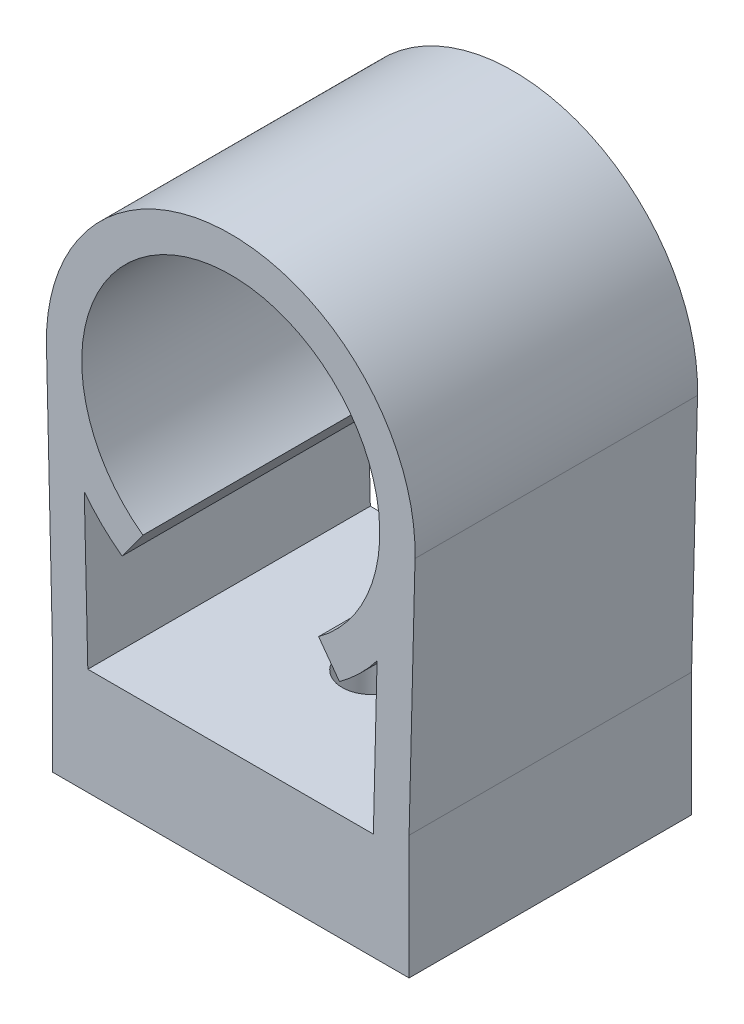
ISO-10303-21;
HEADER;
FILE_DESCRIPTION(('STEP AP214'),'2;1');
FILE_NAME('part.step','',(''),(''),'','','');
FILE_SCHEMA(('AUTOMOTIVE_DESIGN { 1 0 10303 214 1 1 1 1 }'));
ENDSEC;
DATA;
#1=APPLICATION_CONTEXT('core data for automotive mechanical design processes');
#2=APPLICATION_PROTOCOL_DEFINITION('international standard','automotive_design',2000,#1);
#3=PRODUCT_CONTEXT('',#1,'mechanical');
#4=PRODUCT('Part','Part','',(#3));
#5=PRODUCT_RELATED_PRODUCT_CATEGORY('part','',(#4));
#6=PRODUCT_DEFINITION_FORMATION('','',#4);
#7=PRODUCT_DEFINITION_CONTEXT('part definition',#1,'design');
#8=PRODUCT_DEFINITION('design','',#6,#7);
#9=PRODUCT_DEFINITION_SHAPE('','',#8);
#10=(LENGTH_UNIT() NAMED_UNIT(*) SI_UNIT(.MILLI.,.METRE.));
#11=(NAMED_UNIT(*) PLANE_ANGLE_UNIT() SI_UNIT($,.RADIAN.));
#12=(NAMED_UNIT(*) SI_UNIT($,.STERADIAN.) SOLID_ANGLE_UNIT());
#13=UNCERTAINTY_MEASURE_WITH_UNIT(LENGTH_MEASURE(1.E-05),#10,'distance_accuracy_value','');
#14=(GEOMETRIC_REPRESENTATION_CONTEXT(3) GLOBAL_UNCERTAINTY_ASSIGNED_CONTEXT((#13)) GLOBAL_UNIT_ASSIGNED_CONTEXT((#10,
#11,#12)) REPRESENTATION_CONTEXT('',''));
#15=CARTESIAN_POINT('',(0.,0.,0.));
#16=DIRECTION('',(0.,0.,1.));
#17=DIRECTION('',(1.,0.,0.));
#18=AXIS2_PLACEMENT_3D('',#15,#16,#17);
#19=CARTESIAN_POINT('',(12.827,26.67,20.32));
#20=DIRECTION('',(0.,0.,1.));
#21=DIRECTION('',(1.,0.,0.));
#22=AXIS2_PLACEMENT_3D('',#19,#20,#21);
#23=PLANE('',#22);
#24=DIRECTION('',(0.,-1.,0.));
#25=VECTOR('',#24,1.);
#26=CARTESIAN_POINT('',(0.,0.,20.32));
#27=LINE('',#26,#25);
#28=CARTESIAN_POINT('',(0.,7.874,20.32));
#29=VERTEX_POINT('',#28);
#30=CARTESIAN_POINT('',(0.,0.,20.32));
#31=VERTEX_POINT('',#30);
#32=EDGE_CURVE('E204',#29,#31,#27,.T.);
#33=ORIENTED_EDGE('',*,*,#32,.T.);
#34=DIRECTION('',(1.,0.,0.));
#35=VECTOR('',#34,1.);
#36=CARTESIAN_POINT('',(0.,0.,20.32));
#37=LINE('',#36,#35);
#38=CARTESIAN_POINT('',(25.654,0.,20.32));
#39=VERTEX_POINT('',#38);
#40=EDGE_CURVE('E207',#31,#39,#37,.T.);
#41=ORIENTED_EDGE('',*,*,#40,.T.);
#42=DIRECTION('',(0.,1.,0.));
#43=VECTOR('',#42,1.);
#44=CARTESIAN_POINT('',(25.654,0.,20.32));
#45=LINE('',#44,#43);
#46=CARTESIAN_POINT('',(25.654,8.89,20.32));
#47=VERTEX_POINT('',#46);
#48=EDGE_CURVE('E210',#39,#47,#45,.T.);
#49=ORIENTED_EDGE('',*,*,#48,.T.);
#50=DIRECTION('',(0.0245023063150946,0.999699773424622,0.));
#51=VECTOR('',#50,1.);
#52=CARTESIAN_POINT('',(25.654,8.89,20.32));
#53=LINE('',#52,#51);
#54=CARTESIAN_POINT('',(26.0818193558824,26.3451288210294,20.32));
#55=VERTEX_POINT('',#54);
#56=EDGE_CURVE('E212',#47,#55,#53,.T.);
#57=ORIENTED_EDGE('',*,*,#56,.T.);
#58=CARTESIAN_POINT('',(12.827,26.67,20.32));
#59=DIRECTION('',(0.,0.,1.));
#60=DIRECTION('',(1.,0.,0.));
#61=AXIS2_PLACEMENT_3D('',#58,#59,#60);
#62=CIRCLE('',#61,13.2588);
#63=CARTESIAN_POINT('',(-0.428244850040576,26.3629797963115,20.32));
#64=VERTEX_POINT('',#63);
#65=EDGE_CURVE('E214',#55,#64,#62,.T.);
#66=ORIENTED_EDGE('',*,*,#65,.T.);
#67=DIRECTION('',(0.0231559570766986,-0.999731864877709,0.));
#68=VECTOR('',#67,1.);
#69=CARTESIAN_POINT('',(0.,7.874,20.32));
#70=LINE('',#69,#68);
#71=EDGE_CURVE('E216',#64,#29,#70,.T.);
#72=ORIENTED_EDGE('',*,*,#71,.T.);
#73=EDGE_LOOP('',(#33,#41,#49,#57,#66,#72));
#74=FACE_BOUND('',#73,.T.);
#75=DIRECTION('',(0.0231559570766986,-0.999731864877709,0.));
#76=VECTOR('',#75,1.);
#77=CARTESIAN_POINT('',(2.54519400540802,7.67916678765708,20.32));
#78=LINE('',#77,#76);
#79=CARTESIAN_POINT('',(2.29178419648612,18.6198443857655,20.32));
#80=VERTEX_POINT('',#79);
#81=CARTESIAN_POINT('',(2.54519400540802,7.67916678765708,20.32));
#82=VERTEX_POINT('',#81);
#83=EDGE_CURVE('E145',#80,#82,#78,.T.);
#84=ORIENTED_EDGE('',*,*,#83,.F.);
#85=CARTESIAN_POINT('',(12.827,26.67,20.32));
#86=DIRECTION('',(0.,0.,-1.));
#87=DIRECTION('',(1.,0.,0.));
#88=AXIS2_PLACEMENT_3D('',#85,#86,#87);
#89=CIRCLE('',#88,13.2588);
#90=CARTESIAN_POINT('',(5.00955556951835,15.9609692307692,20.32));
#91=VERTEX_POINT('',#90);
#92=EDGE_CURVE('E137',#91,#80,#89,.T.);
#93=ORIENTED_EDGE('',*,*,#92,.F.);
#94=DIRECTION('',(-0.589604219875226,-0.807692307692308,0.));
#95=VECTOR('',#94,1.);
#96=CARTESIAN_POINT('',(5.00955556951835,15.9609692307692,20.32));
#97=LINE('',#96,#95);
#98=CARTESIAN_POINT('',(6.50715028800142,18.0125076923077,20.32));
#99=VERTEX_POINT('',#98);
#100=EDGE_CURVE('E171',#99,#91,#97,.T.);
#101=ORIENTED_EDGE('',*,*,#100,.F.);
#102=CARTESIAN_POINT('',(12.827,26.67,20.32));
#103=DIRECTION('',(0.,0.,1.));
#104=DIRECTION('',(1.,0.,0.));
#105=AXIS2_PLACEMENT_3D('',#102,#103,#104);
#106=CIRCLE('',#105,10.7188);
#107=CARTESIAN_POINT('',(19.1468497119986,18.0125076923077,20.32));
#108=VERTEX_POINT('',#107);
#109=EDGE_CURVE('E169',#108,#99,#106,.T.);
#110=ORIENTED_EDGE('',*,*,#109,.F.);
#111=DIRECTION('',(-0.589604219875227,0.807692307692308,0.));
#112=VECTOR('',#111,1.);
#113=CARTESIAN_POINT('',(20.6444444304817,15.9609692307692,20.32));
#114=LINE('',#113,#112);
#115=CARTESIAN_POINT('',(20.6444444304817,15.9609692307692,20.32));
#116=VERTEX_POINT('',#115);
#117=EDGE_CURVE('E167',#116,#108,#114,.T.);
#118=ORIENTED_EDGE('',*,*,#117,.F.);
#119=CARTESIAN_POINT('',(12.827,26.67,20.32));
#120=DIRECTION('',(0.,0.,-1.));
#121=DIRECTION('',(1.,0.,0.));
#122=AXIS2_PLACEMENT_3D('',#119,#120,#121);
#123=CIRCLE('',#122,13.2588);
#124=CARTESIAN_POINT('',(23.3513648528432,18.6056635806634,20.32));
#125=VERTEX_POINT('',#124);
#126=EDGE_CURVE('E165',#125,#116,#123,.T.);
#127=ORIENTED_EDGE('',*,*,#126,.F.);
#128=DIRECTION('',(0.0245023063150942,0.999699773424622,0.));
#129=VECTOR('',#128,1.);
#130=CARTESIAN_POINT('',(23.0835600793601,7.67916678765708,20.32));
#131=LINE('',#130,#129);
#132=CARTESIAN_POINT('',(23.0835600793601,7.67916678765708,20.32));
#133=VERTEX_POINT('',#132);
#134=EDGE_CURVE('E160',#133,#125,#131,.T.);
#135=ORIENTED_EDGE('',*,*,#134,.F.);
#136=DIRECTION('',(1.,0.,0.));
#137=VECTOR('',#136,1.);
#138=CARTESIAN_POINT('',(2.54519400540802,7.67916678765708,20.32));
#139=LINE('',#138,#137);
#140=EDGE_CURVE('E158',#82,#133,#139,.T.);
#141=ORIENTED_EDGE('',*,*,#140,.F.);
#142=EDGE_LOOP('',(#84,#93,#101,#110,#118,#127,#135,#141));
#143=FACE_BOUND('',#142,.T.);
#144=ADVANCED_FACE('F36',(#74,#143),#23,.T.);
#145=CARTESIAN_POINT('',(12.827,26.67,0.));
#146=DIRECTION('',(0.,0.,1.));
#147=DIRECTION('',(1.,0.,0.));
#148=AXIS2_PLACEMENT_3D('',#145,#146,#147);
#149=PLANE('',#148);
#150=DIRECTION('',(0.,-1.,0.));
#151=VECTOR('',#150,1.);
#152=CARTESIAN_POINT('',(0.,0.,0.));
#153=LINE('',#152,#151);
#154=CARTESIAN_POINT('',(0.,7.874,0.));
#155=VERTEX_POINT('',#154);
#156=CARTESIAN_POINT('',(0.,0.,0.));
#157=VERTEX_POINT('',#156);
#158=EDGE_CURVE('E153',#155,#157,#153,.T.);
#159=ORIENTED_EDGE('',*,*,#158,.F.);
#160=DIRECTION('',(0.0231559570766986,-0.999731864877709,0.));
#161=VECTOR('',#160,1.);
#162=CARTESIAN_POINT('',(0.,7.874,0.));
#163=LINE('',#162,#161);
#164=CARTESIAN_POINT('',(-0.428244850040576,26.3629797963115,0.));
#165=VERTEX_POINT('',#164);
#166=EDGE_CURVE('E208',#165,#155,#163,.T.);
#167=ORIENTED_EDGE('',*,*,#166,.F.);
#168=CARTESIAN_POINT('',(12.827,26.67,0.));
#169=DIRECTION('',(0.,0.,1.));
#170=DIRECTION('',(1.,0.,0.));
#171=AXIS2_PLACEMENT_3D('',#168,#169,#170);
#172=CIRCLE('',#171,13.2588);
#173=CARTESIAN_POINT('',(26.0818193558824,26.3451288210294,0.));
#174=VERTEX_POINT('',#173);
#175=EDGE_CURVE('E227',#174,#165,#172,.T.);
#176=ORIENTED_EDGE('',*,*,#175,.F.);
#177=DIRECTION('',(0.0245023063150946,0.999699773424622,0.));
#178=VECTOR('',#177,1.);
#179=CARTESIAN_POINT('',(25.654,8.89,0.));
#180=LINE('',#179,#178);
#181=CARTESIAN_POINT('',(25.654,8.89,0.));
#182=VERTEX_POINT('',#181);
#183=EDGE_CURVE('E225',#182,#174,#180,.T.);
#184=ORIENTED_EDGE('',*,*,#183,.F.);
#185=DIRECTION('',(0.,1.,0.));
#186=VECTOR('',#185,1.);
#187=CARTESIAN_POINT('',(25.654,0.,0.));
#188=LINE('',#187,#186);
#189=CARTESIAN_POINT('',(25.654,0.,0.));
#190=VERTEX_POINT('',#189);
#191=EDGE_CURVE('E223',#190,#182,#188,.T.);
#192=ORIENTED_EDGE('',*,*,#191,.F.);
#193=DIRECTION('',(1.,0.,0.));
#194=VECTOR('',#193,1.);
#195=CARTESIAN_POINT('',(0.,0.,0.));
#196=LINE('',#195,#194);
#197=EDGE_CURVE('E221',#157,#190,#196,.T.);
#198=ORIENTED_EDGE('',*,*,#197,.F.);
#199=EDGE_LOOP('',(#159,#167,#176,#184,#192,#198));
#200=FACE_BOUND('',#199,.T.);
#201=CARTESIAN_POINT('',(12.827,26.67,0.));
#202=DIRECTION('',(0.,0.,-1.));
#203=DIRECTION('',(1.,0.,0.));
#204=AXIS2_PLACEMENT_3D('',#201,#202,#203);
#205=CIRCLE('',#204,13.2588);
#206=CARTESIAN_POINT('',(5.00955556951834,15.9609692307692,0.));
#207=VERTEX_POINT('',#206);
#208=CARTESIAN_POINT('',(2.29178419648612,18.6198443857655,0.));
#209=VERTEX_POINT('',#208);
#210=EDGE_CURVE('E59',#207,#209,#205,.T.);
#211=ORIENTED_EDGE('',*,*,#210,.T.);
#212=DIRECTION('',(0.0231559570766986,-0.999731864877709,0.));
#213=VECTOR('',#212,1.);
#214=CARTESIAN_POINT('',(2.54519400540802,7.67916678765708,0.));
#215=LINE('',#214,#213);
#216=CARTESIAN_POINT('',(2.54519400540802,7.67916678765708,0.));
#217=VERTEX_POINT('',#216);
#218=EDGE_CURVE('E152',#209,#217,#215,.T.);
#219=ORIENTED_EDGE('',*,*,#218,.T.);
#220=DIRECTION('',(1.,0.,0.));
#221=VECTOR('',#220,1.);
#222=CARTESIAN_POINT('',(2.54519400540802,7.67916678765708,0.));
#223=LINE('',#222,#221);
#224=CARTESIAN_POINT('',(23.0835600793601,7.67916678765708,0.));
#225=VERTEX_POINT('',#224);
#226=EDGE_CURVE('E176',#217,#225,#223,.T.);
#227=ORIENTED_EDGE('',*,*,#226,.T.);
#228=DIRECTION('',(0.0245023063150942,0.999699773424622,0.));
#229=VECTOR('',#228,1.);
#230=CARTESIAN_POINT('',(23.0835600793601,7.67916678765708,0.));
#231=LINE('',#230,#229);
#232=CARTESIAN_POINT('',(23.3513648528432,18.6056635806634,0.));
#233=VERTEX_POINT('',#232);
#234=EDGE_CURVE('E179',#225,#233,#231,.T.);
#235=ORIENTED_EDGE('',*,*,#234,.T.);
#236=CARTESIAN_POINT('',(12.827,26.67,0.));
#237=DIRECTION('',(0.,0.,-1.));
#238=DIRECTION('',(1.,0.,0.));
#239=AXIS2_PLACEMENT_3D('',#236,#237,#238);
#240=CIRCLE('',#239,13.2588);
#241=CARTESIAN_POINT('',(20.6444444304817,15.9609692307692,0.));
#242=VERTEX_POINT('',#241);
#243=EDGE_CURVE('E182',#233,#242,#240,.T.);
#244=ORIENTED_EDGE('',*,*,#243,.T.);
#245=DIRECTION('',(-0.589604219875227,0.807692307692308,0.));
#246=VECTOR('',#245,1.);
#247=CARTESIAN_POINT('',(20.6444444304817,15.9609692307692,0.));
#248=LINE('',#247,#246);
#249=CARTESIAN_POINT('',(19.1468497119986,18.0125076923077,0.));
#250=VERTEX_POINT('',#249);
#251=EDGE_CURVE('E185',#242,#250,#248,.T.);
#252=ORIENTED_EDGE('',*,*,#251,.T.);
#253=CARTESIAN_POINT('',(12.827,26.67,0.));
#254=DIRECTION('',(0.,0.,1.));
#255=DIRECTION('',(1.,0.,0.));
#256=AXIS2_PLACEMENT_3D('',#253,#254,#255);
#257=CIRCLE('',#256,10.7188);
#258=CARTESIAN_POINT('',(6.50715028800142,18.0125076923077,0.));
#259=VERTEX_POINT('',#258);
#260=EDGE_CURVE('E188',#250,#259,#257,.T.);
#261=ORIENTED_EDGE('',*,*,#260,.T.);
#262=DIRECTION('',(-0.589604219875226,-0.807692307692308,0.));
#263=VECTOR('',#262,1.);
#264=CARTESIAN_POINT('',(5.00955556951835,15.9609692307692,0.));
#265=LINE('',#264,#263);
#266=EDGE_CURVE('E146',#259,#207,#265,.T.);
#267=ORIENTED_EDGE('',*,*,#266,.T.);
#268=EDGE_LOOP('',(#211,#219,#227,#235,#244,#252,#261,#267));
#269=FACE_BOUND('',#268,.T.);
#270=ADVANCED_FACE('F251',(#200,#269),#149,.F.);
#271=CARTESIAN_POINT('',(0.,0.,20.32));
#272=DIRECTION('',(1.,0.,0.));
#273=DIRECTION('',(0.,0.,-1.));
#274=AXIS2_PLACEMENT_3D('',#271,#272,#273);
#275=PLANE('',#274);
#276=ORIENTED_EDGE('',*,*,#158,.T.);
#277=DIRECTION('',(0.,0.,-1.));
#278=VECTOR('',#277,1.);
#279=CARTESIAN_POINT('',(0.,0.,20.32));
#280=LINE('',#279,#278);
#281=EDGE_CURVE('E11',#31,#157,#280,.T.);
#282=ORIENTED_EDGE('',*,*,#281,.F.);
#283=ORIENTED_EDGE('',*,*,#32,.F.);
#284=DIRECTION('',(0.,0.,-1.));
#285=VECTOR('',#284,1.);
#286=CARTESIAN_POINT('',(0.,7.874,20.32));
#287=LINE('',#286,#285);
#288=EDGE_CURVE('E218',#29,#155,#287,.T.);
#289=ORIENTED_EDGE('',*,*,#288,.T.);
#290=EDGE_LOOP('',(#276,#282,#283,#289));
#291=FACE_BOUND('',#290,.T.);
#292=ADVANCED_FACE('F38',(#291),#275,.F.);
#293=CARTESIAN_POINT('',(0.,0.,20.32));
#294=DIRECTION('',(0.,1.,0.));
#295=DIRECTION('',(0.,0.,1.));
#296=AXIS2_PLACEMENT_3D('',#293,#294,#295);
#297=PLANE('',#296);
#298=CARTESIAN_POINT('',(12.827,0.,10.16));
#299=DIRECTION('',(0.,-1.,0.));
#300=DIRECTION('',(0.,0.,-1.));
#301=AXIS2_PLACEMENT_3D('',#298,#299,#300);
#302=CIRCLE('',#301,2.15265);
#303=CARTESIAN_POINT('',(12.827,0.,8.00735000000001));
#304=VERTEX_POINT('',#303);
#305=EDGE_CURVE('E320',#304,#304,#302,.T.);
#306=ORIENTED_EDGE('',*,*,#305,.F.);
#307=EDGE_LOOP('',(#306));
#308=FACE_BOUND('',#307,.T.);
#309=ORIENTED_EDGE('',*,*,#197,.T.);
#310=DIRECTION('',(0.,0.,-1.));
#311=VECTOR('',#310,1.);
#312=CARTESIAN_POINT('',(25.654,0.,20.32));
#313=LINE('',#312,#311);
#314=EDGE_CURVE('E44',#39,#190,#313,.T.);
#315=ORIENTED_EDGE('',*,*,#314,.F.);
#316=ORIENTED_EDGE('',*,*,#40,.F.);
#317=ORIENTED_EDGE('',*,*,#281,.T.);
#318=EDGE_LOOP('',(#309,#315,#316,#317));
#319=FACE_BOUND('',#318,.T.);
#320=ADVANCED_FACE('F268',(#308,#319),#297,.F.);
#321=CARTESIAN_POINT('',(25.654,0.,20.32));
#322=DIRECTION('',(-1.,0.,0.));
#323=DIRECTION('',(0.,-1.,0.));
#324=AXIS2_PLACEMENT_3D('',#321,#322,#323);
#325=PLANE('',#324);
#326=ORIENTED_EDGE('',*,*,#191,.T.);
#327=DIRECTION('',(0.,0.,-1.));
#328=VECTOR('',#327,1.);
#329=CARTESIAN_POINT('',(25.654,8.89,20.32));
#330=LINE('',#329,#328);
#331=EDGE_CURVE('E238',#47,#182,#330,.T.);
#332=ORIENTED_EDGE('',*,*,#331,.F.);
#333=ORIENTED_EDGE('',*,*,#48,.F.);
#334=ORIENTED_EDGE('',*,*,#314,.T.);
#335=EDGE_LOOP('',(#326,#332,#333,#334));
#336=FACE_BOUND('',#335,.T.);
#337=ADVANCED_FACE('F245',(#336),#325,.F.);
#338=CARTESIAN_POINT('',(25.654,8.89,20.32));
#339=DIRECTION('',(-0.999699773424622,0.0245023063150946,0.));
#340=DIRECTION('',(-0.0245023063150946,-0.999699773424622,0.));
#341=AXIS2_PLACEMENT_3D('',#338,#339,#340);
#342=PLANE('',#341);
#343=ORIENTED_EDGE('',*,*,#183,.T.);
#344=DIRECTION('',(0.,0.,-1.));
#345=VECTOR('',#344,1.);
#346=CARTESIAN_POINT('',(26.0818193558824,26.3451288210294,20.32));
#347=LINE('',#346,#345);
#348=EDGE_CURVE('E235',#55,#174,#347,.T.);
#349=ORIENTED_EDGE('',*,*,#348,.F.);
#350=ORIENTED_EDGE('',*,*,#56,.F.);
#351=ORIENTED_EDGE('',*,*,#331,.T.);
#352=EDGE_LOOP('',(#343,#349,#350,#351));
#353=FACE_BOUND('',#352,.T.);
#354=ADVANCED_FACE('F257',(#353),#342,.F.);
#355=CARTESIAN_POINT('',(12.827,26.67,20.32));
#356=DIRECTION('',(0.,0.,-1.));
#357=DIRECTION('',(-1.,0.,0.));
#358=AXIS2_PLACEMENT_3D('',#355,#356,#357);
#359=CYLINDRICAL_SURFACE('',#358,13.2588);
#360=ORIENTED_EDGE('',*,*,#175,.T.);
#361=DIRECTION('',(0.,0.,-1.));
#362=VECTOR('',#361,1.);
#363=CARTESIAN_POINT('',(-0.428244850040576,26.3629797963115,20.32));
#364=LINE('',#363,#362);
#365=EDGE_CURVE('E232',#64,#165,#364,.T.);
#366=ORIENTED_EDGE('',*,*,#365,.F.);
#367=ORIENTED_EDGE('',*,*,#65,.F.);
#368=ORIENTED_EDGE('',*,*,#348,.T.);
#369=EDGE_LOOP('',(#360,#366,#367,#368));
#370=FACE_BOUND('',#369,.T.);
#371=ADVANCED_FACE('F261',(#370),#359,.T.);
#372=CARTESIAN_POINT('',(0.,7.874,20.32));
#373=DIRECTION('',(0.999731864877709,0.0231559570766986,0.));
#374=DIRECTION('',(-0.0231559570766986,0.999731864877709,0.));
#375=AXIS2_PLACEMENT_3D('',#372,#373,#374);
#376=PLANE('',#375);
#377=ORIENTED_EDGE('',*,*,#166,.T.);
#378=ORIENTED_EDGE('',*,*,#288,.F.);
#379=ORIENTED_EDGE('',*,*,#71,.F.);
#380=ORIENTED_EDGE('',*,*,#365,.T.);
#381=EDGE_LOOP('',(#377,#378,#379,#380));
#382=FACE_BOUND('',#381,.T.);
#383=ADVANCED_FACE('F271',(#382),#376,.F.);
#384=CARTESIAN_POINT('',(12.827,26.67,20.32));
#385=DIRECTION('',(0.,0.,-1.));
#386=DIRECTION('',(-1.,0.,0.));
#387=AXIS2_PLACEMENT_3D('',#384,#385,#386);
#388=CYLINDRICAL_SURFACE('',#387,13.2588);
#389=ORIENTED_EDGE('',*,*,#210,.F.);
#390=DIRECTION('',(0.,0.,-1.));
#391=VECTOR('',#390,1.);
#392=CARTESIAN_POINT('',(5.00955556951835,15.9609692307692,20.32));
#393=LINE('',#392,#391);
#394=EDGE_CURVE('E141',#91,#207,#393,.T.);
#395=ORIENTED_EDGE('',*,*,#394,.F.);
#396=ORIENTED_EDGE('',*,*,#92,.T.);
#397=DIRECTION('',(0.,0.,-1.));
#398=VECTOR('',#397,1.);
#399=CARTESIAN_POINT('',(2.29178419648612,18.6198443857655,20.32));
#400=LINE('',#399,#398);
#401=EDGE_CURVE('E140',#80,#209,#400,.T.);
#402=ORIENTED_EDGE('',*,*,#401,.T.);
#403=EDGE_LOOP('',(#389,#395,#396,#402));
#404=FACE_BOUND('',#403,.T.);
#405=ADVANCED_FACE('F139',(#404),#388,.T.);
#406=CARTESIAN_POINT('',(2.54519400540802,7.67916678765708,20.32));
#407=DIRECTION('',(0.999731864877709,0.0231559570766986,0.));
#408=DIRECTION('',(-0.0231559570766986,0.999731864877709,0.));
#409=AXIS2_PLACEMENT_3D('',#406,#407,#408);
#410=PLANE('',#409);
#411=ORIENTED_EDGE('',*,*,#218,.F.);
#412=ORIENTED_EDGE('',*,*,#401,.F.);
#413=ORIENTED_EDGE('',*,*,#83,.T.);
#414=DIRECTION('',(0.,0.,-1.));
#415=VECTOR('',#414,1.);
#416=CARTESIAN_POINT('',(2.54519400540802,7.67916678765708,20.32));
#417=LINE('',#416,#415);
#418=EDGE_CURVE('E154',#82,#217,#417,.T.);
#419=ORIENTED_EDGE('',*,*,#418,.T.);
#420=EDGE_LOOP('',(#411,#412,#413,#419));
#421=FACE_BOUND('',#420,.T.);
#422=ADVANCED_FACE('F149',(#421),#410,.T.);
#423=CARTESIAN_POINT('',(2.54519400540802,7.67916678765708,20.32));
#424=DIRECTION('',(0.,1.,0.));
#425=DIRECTION('',(-1.,0.,0.));
#426=AXIS2_PLACEMENT_3D('',#423,#424,#425);
#427=PLANE('',#426);
#428=CARTESIAN_POINT('',(12.827,7.67916678765708,10.16));
#429=DIRECTION('',(0.,1.,0.));
#430=DIRECTION('',(-1.,0.,0.));
#431=AXIS2_PLACEMENT_3D('',#428,#429,#430);
#432=CIRCLE('',#431,2.15265);
#433=CARTESIAN_POINT('',(10.67435,7.67916678765708,10.16));
#434=VERTEX_POINT('',#433);
#435=EDGE_CURVE('E174',#434,#434,#432,.T.);
#436=ORIENTED_EDGE('',*,*,#435,.F.);
#437=EDGE_LOOP('',(#436));
#438=FACE_BOUND('',#437,.T.);
#439=ORIENTED_EDGE('',*,*,#226,.F.);
#440=ORIENTED_EDGE('',*,*,#418,.F.);
#441=ORIENTED_EDGE('',*,*,#140,.T.);
#442=DIRECTION('',(0.,0.,-1.));
#443=VECTOR('',#442,1.);
#444=CARTESIAN_POINT('',(23.0835600793601,7.67916678765708,20.32));
#445=LINE('',#444,#443);
#446=EDGE_CURVE('E201',#133,#225,#445,.T.);
#447=ORIENTED_EDGE('',*,*,#446,.T.);
#448=EDGE_LOOP('',(#439,#440,#441,#447));
#449=FACE_BOUND('',#448,.T.);
#450=ADVANCED_FACE('F289',(#438,#449),#427,.T.);
#451=CARTESIAN_POINT('',(23.0835600793601,7.67916678765708,20.32));
#452=DIRECTION('',(-0.999699773424622,0.0245023063150942,0.));
#453=DIRECTION('',(-0.0245023063150942,-0.999699773424622,0.));
#454=AXIS2_PLACEMENT_3D('',#451,#452,#453);
#455=PLANE('',#454);
#456=ORIENTED_EDGE('',*,*,#234,.F.);
#457=ORIENTED_EDGE('',*,*,#446,.F.);
#458=ORIENTED_EDGE('',*,*,#134,.T.);
#459=DIRECTION('',(0.,0.,-1.));
#460=VECTOR('',#459,1.);
#461=CARTESIAN_POINT('',(23.3513648528432,18.6056635806634,20.32));
#462=LINE('',#461,#460);
#463=EDGE_CURVE('E199',#125,#233,#462,.T.);
#464=ORIENTED_EDGE('',*,*,#463,.T.);
#465=EDGE_LOOP('',(#456,#457,#458,#464));
#466=FACE_BOUND('',#465,.T.);
#467=ADVANCED_FACE('F292',(#466),#455,.T.);
#468=CARTESIAN_POINT('',(12.827,26.67,20.32));
#469=DIRECTION('',(0.,0.,-1.));
#470=DIRECTION('',(-1.,0.,0.));
#471=AXIS2_PLACEMENT_3D('',#468,#469,#470);
#472=CYLINDRICAL_SURFACE('',#471,13.2588);
#473=ORIENTED_EDGE('',*,*,#243,.F.);
#474=ORIENTED_EDGE('',*,*,#463,.F.);
#475=ORIENTED_EDGE('',*,*,#126,.T.);
#476=DIRECTION('',(0.,0.,-1.));
#477=VECTOR('',#476,1.);
#478=CARTESIAN_POINT('',(20.6444444304817,15.9609692307692,20.32));
#479=LINE('',#478,#477);
#480=EDGE_CURVE('E197',#116,#242,#479,.T.);
#481=ORIENTED_EDGE('',*,*,#480,.T.);
#482=EDGE_LOOP('',(#473,#474,#475,#481));
#483=FACE_BOUND('',#482,.T.);
#484=ADVANCED_FACE('F296',(#483),#472,.T.);
#485=CARTESIAN_POINT('',(20.6444444304817,15.9609692307692,20.32));
#486=DIRECTION('',(-0.807692307692308,-0.589604219875227,0.));
#487=DIRECTION('',(0.589604219875227,-0.807692307692308,0.));
#488=AXIS2_PLACEMENT_3D('',#485,#486,#487);
#489=PLANE('',#488);
#490=ORIENTED_EDGE('',*,*,#251,.F.);
#491=ORIENTED_EDGE('',*,*,#480,.F.);
#492=ORIENTED_EDGE('',*,*,#117,.T.);
#493=DIRECTION('',(0.,0.,-1.));
#494=VECTOR('',#493,1.);
#495=CARTESIAN_POINT('',(19.1468497119986,18.0125076923077,20.32));
#496=LINE('',#495,#494);
#497=EDGE_CURVE('E195',#108,#250,#496,.T.);
#498=ORIENTED_EDGE('',*,*,#497,.T.);
#499=EDGE_LOOP('',(#490,#491,#492,#498));
#500=FACE_BOUND('',#499,.T.);
#501=ADVANCED_FACE('F300',(#500),#489,.T.);
#502=CARTESIAN_POINT('',(12.827,26.67,20.32));
#503=DIRECTION('',(0.,0.,-1.));
#504=DIRECTION('',(-1.,0.,0.));
#505=AXIS2_PLACEMENT_3D('',#502,#503,#504);
#506=CYLINDRICAL_SURFACE('',#505,10.7188);
#507=ORIENTED_EDGE('',*,*,#260,.F.);
#508=ORIENTED_EDGE('',*,*,#497,.F.);
#509=ORIENTED_EDGE('',*,*,#109,.T.);
#510=DIRECTION('',(0.,0.,-1.));
#511=VECTOR('',#510,1.);
#512=CARTESIAN_POINT('',(6.50715028800142,18.0125076923077,20.32));
#513=LINE('',#512,#511);
#514=EDGE_CURVE('E51',#99,#259,#513,.T.);
#515=ORIENTED_EDGE('',*,*,#514,.T.);
#516=EDGE_LOOP('',(#507,#508,#509,#515));
#517=FACE_BOUND('',#516,.T.);
#518=ADVANCED_FACE('F304',(#517),#506,.F.);
#519=CARTESIAN_POINT('',(5.00955556951835,15.9609692307692,20.32));
#520=DIRECTION('',(0.807692307692308,-0.589604219875226,0.));
#521=DIRECTION('',(0.589604219875226,0.807692307692308,0.));
#522=AXIS2_PLACEMENT_3D('',#519,#520,#521);
#523=PLANE('',#522);
#524=ORIENTED_EDGE('',*,*,#266,.F.);
#525=ORIENTED_EDGE('',*,*,#514,.F.);
#526=ORIENTED_EDGE('',*,*,#100,.T.);
#527=ORIENTED_EDGE('',*,*,#394,.T.);
#528=EDGE_LOOP('',(#524,#525,#526,#527));
#529=FACE_BOUND('',#528,.T.);
#530=ADVANCED_FACE('F308',(#529),#523,.T.);
#531=CARTESIAN_POINT('',(12.827,0.,10.16));
#532=DIRECTION('',(0.,-1.,0.));
#533=DIRECTION('',(0.,0.,-1.));
#534=AXIS2_PLACEMENT_3D('',#531,#532,#533);
#535=CYLINDRICAL_SURFACE('',#534,2.15265);
#536=ORIENTED_EDGE('',*,*,#305,.T.);
#537=EDGE_LOOP('',(#536));
#538=FACE_BOUND('',#537,.T.);
#539=ORIENTED_EDGE('',*,*,#435,.T.);
#540=EDGE_LOOP('',(#539));
#541=FACE_BOUND('',#540,.T.);
#542=ADVANCED_FACE('F312',(#538,#541),#535,.F.);
#543=CLOSED_SHELL('',(#144,#270,#292,#320,#337,#354,#371,#383,#405,#422,#450,#467,#484,#501,
#518,#530,#542));
#544=MANIFOLD_SOLID_BREP('B2',#543);
#545=ADVANCED_BREP_SHAPE_REPRESENTATION('',(#18,#544),#14);
#546=SHAPE_DEFINITION_REPRESENTATION(#9,#545);
ENDSEC;
END-ISO-10303-21;
